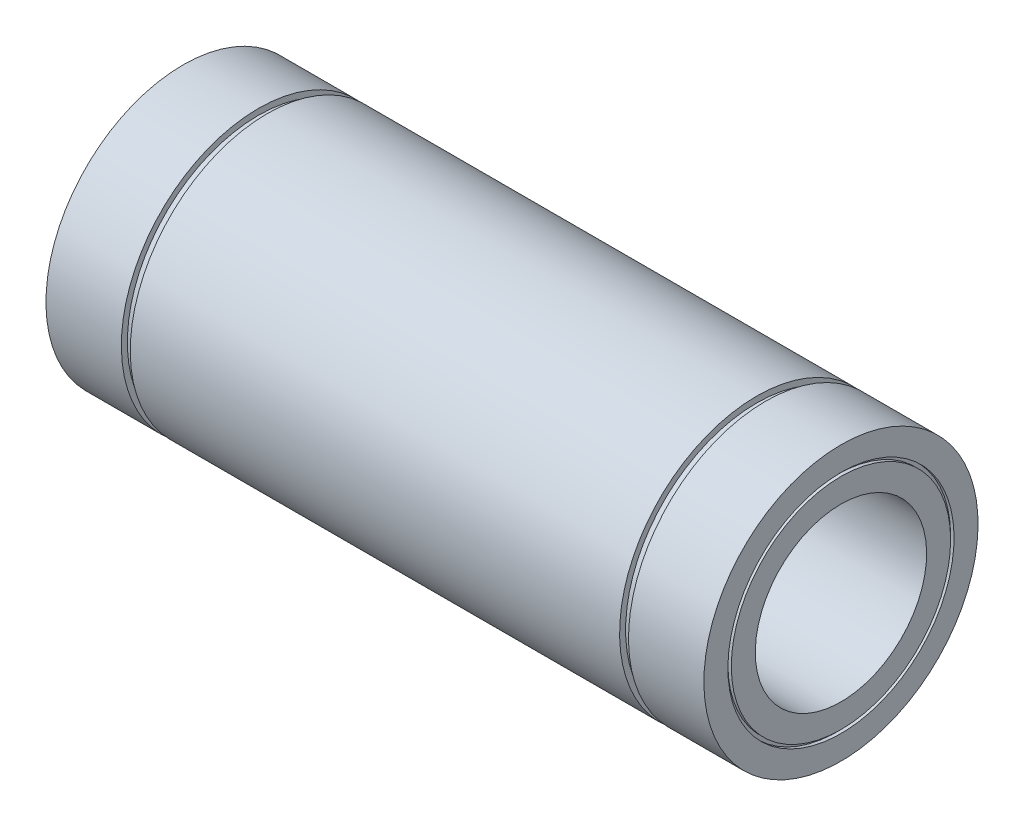
ISO-10303-21;
HEADER;
FILE_DESCRIPTION(('STEP AP214'),'2;1');
FILE_NAME('part.step','',(''),(''),'','','');
FILE_SCHEMA(('AUTOMOTIVE_DESIGN { 1 0 10303 214 1 1 1 1 }'));
ENDSEC;
DATA;
#1=APPLICATION_CONTEXT('core data for automotive mechanical design processes');
#2=APPLICATION_PROTOCOL_DEFINITION('international standard','automotive_design',2000,#1);
#3=PRODUCT_CONTEXT('',#1,'mechanical');
#4=PRODUCT('Part','Part','',(#3));
#5=PRODUCT_RELATED_PRODUCT_CATEGORY('part','',(#4));
#6=PRODUCT_DEFINITION_FORMATION('','',#4);
#7=PRODUCT_DEFINITION_CONTEXT('part definition',#1,'design');
#8=PRODUCT_DEFINITION('design','',#6,#7);
#9=PRODUCT_DEFINITION_SHAPE('','',#8);
#10=(LENGTH_UNIT() NAMED_UNIT(*) SI_UNIT(.MILLI.,.METRE.));
#11=(NAMED_UNIT(*) PLANE_ANGLE_UNIT() SI_UNIT($,.RADIAN.));
#12=(NAMED_UNIT(*) SI_UNIT($,.STERADIAN.) SOLID_ANGLE_UNIT());
#13=UNCERTAINTY_MEASURE_WITH_UNIT(LENGTH_MEASURE(1.E-05),#10,'distance_accuracy_value','');
#14=(GEOMETRIC_REPRESENTATION_CONTEXT(3) GLOBAL_UNCERTAINTY_ASSIGNED_CONTEXT((#13)) GLOBAL_UNIT_ASSIGNED_CONTEXT((#10,
#11,#12)) REPRESENTATION_CONTEXT('',''));
#15=CARTESIAN_POINT('',(0.,0.,0.));
#16=DIRECTION('',(0.,0.,1.));
#17=DIRECTION('',(1.,0.,0.));
#18=AXIS2_PLACEMENT_3D('',#15,#16,#17);
#19=CARTESIAN_POINT('',(-96.,33.,0.));
#20=DIRECTION('',(-1.,0.,0.));
#21=DIRECTION('',(0.,-1.,0.));
#22=AXIS2_PLACEMENT_3D('',#19,#20,#21);
#23=PLANE('',#22);
#24=CARTESIAN_POINT('',(-96.,0.,0.));
#25=DIRECTION('',(1.,0.,0.));
#26=DIRECTION('',(0.,1.,0.));
#27=AXIS2_PLACEMENT_3D('',#24,#25,#26);
#28=CIRCLE('',#27,33.);
#29=CARTESIAN_POINT('',(-96.,33.,0.));
#30=VERTEX_POINT('',#29);
#31=EDGE_CURVE('E124',#30,#30,#28,.T.);
#32=ORIENTED_EDGE('',*,*,#31,.T.);
#33=EDGE_LOOP('',(#32));
#34=FACE_BOUND('',#33,.T.);
#35=CARTESIAN_POINT('',(-96.,0.,0.));
#36=DIRECTION('',(1.,0.,0.));
#37=DIRECTION('',(0.,1.,0.));
#38=AXIS2_PLACEMENT_3D('',#35,#36,#37);
#39=CIRCLE('',#38,40.);
#40=CARTESIAN_POINT('',(-96.,40.,0.));
#41=VERTEX_POINT('',#40);
#42=EDGE_CURVE('E10',#41,#41,#39,.T.);
#43=ORIENTED_EDGE('',*,*,#42,.F.);
#44=EDGE_LOOP('',(#43));
#45=FACE_BOUND('',#44,.T.);
#46=ADVANCED_FACE('F40',(#34,#45),#23,.T.);
#47=CARTESIAN_POINT('',(0.,0.,0.));
#48=DIRECTION('',(1.,0.,0.));
#49=DIRECTION('',(0.,1.,0.));
#50=AXIS2_PLACEMENT_3D('',#47,#48,#49);
#51=CYLINDRICAL_SURFACE('',#50,40.);
#52=ORIENTED_EDGE('',*,*,#42,.T.);
#53=EDGE_LOOP('',(#52));
#54=FACE_BOUND('',#53,.T.);
#55=CARTESIAN_POINT('',(-74.,0.,0.));
#56=DIRECTION('',(1.,0.,0.));
#57=DIRECTION('',(0.,1.,0.));
#58=AXIS2_PLACEMENT_3D('',#55,#56,#57);
#59=CIRCLE('',#58,40.);
#60=CARTESIAN_POINT('',(-74.,40.,0.));
#61=VERTEX_POINT('',#60);
#62=EDGE_CURVE('E47',#61,#61,#59,.T.);
#63=ORIENTED_EDGE('',*,*,#62,.F.);
#64=EDGE_LOOP('',(#63));
#65=FACE_BOUND('',#64,.T.);
#66=ADVANCED_FACE('F142',(#54,#65),#51,.T.);
#67=CARTESIAN_POINT('',(-74.,40.,0.));
#68=DIRECTION('',(1.,0.,0.));
#69=DIRECTION('',(0.,1.,0.));
#70=AXIS2_PLACEMENT_3D('',#67,#68,#69);
#71=PLANE('',#70);
#72=ORIENTED_EDGE('',*,*,#62,.T.);
#73=EDGE_LOOP('',(#72));
#74=FACE_BOUND('',#73,.T.);
#75=CARTESIAN_POINT('',(-74.,0.,0.));
#76=DIRECTION('',(1.,0.,0.));
#77=DIRECTION('',(0.,1.,0.));
#78=AXIS2_PLACEMENT_3D('',#75,#76,#77);
#79=CIRCLE('',#78,38.25);
#80=CARTESIAN_POINT('',(-74.,38.25,0.));
#81=VERTEX_POINT('',#80);
#82=EDGE_CURVE('E54',#81,#81,#79,.T.);
#83=ORIENTED_EDGE('',*,*,#82,.F.);
#84=EDGE_LOOP('',(#83));
#85=FACE_BOUND('',#84,.T.);
#86=ADVANCED_FACE('F146',(#74,#85),#71,.T.);
#87=CARTESIAN_POINT('',(0.,0.,0.));
#88=DIRECTION('',(1.,0.,0.));
#89=DIRECTION('',(0.,1.,0.));
#90=AXIS2_PLACEMENT_3D('',#87,#88,#89);
#91=CYLINDRICAL_SURFACE('',#90,38.25);
#92=ORIENTED_EDGE('',*,*,#82,.T.);
#93=EDGE_LOOP('',(#92));
#94=FACE_BOUND('',#93,.T.);
#95=CARTESIAN_POINT('',(-71.4,0.,0.));
#96=DIRECTION('',(1.,0.,0.));
#97=DIRECTION('',(0.,1.,0.));
#98=AXIS2_PLACEMENT_3D('',#95,#96,#97);
#99=CIRCLE('',#98,38.25);
#100=CARTESIAN_POINT('',(-71.4,38.25,0.));
#101=VERTEX_POINT('',#100);
#102=EDGE_CURVE('E61',#101,#101,#99,.T.);
#103=ORIENTED_EDGE('',*,*,#102,.F.);
#104=EDGE_LOOP('',(#103));
#105=FACE_BOUND('',#104,.T.);
#106=ADVANCED_FACE('F150',(#94,#105),#91,.T.);
#107=CARTESIAN_POINT('',(-71.4,38.25,0.));
#108=DIRECTION('',(-1.,0.,0.));
#109=DIRECTION('',(0.,-1.,0.));
#110=AXIS2_PLACEMENT_3D('',#107,#108,#109);
#111=PLANE('',#110);
#112=ORIENTED_EDGE('',*,*,#102,.T.);
#113=EDGE_LOOP('',(#112));
#114=FACE_BOUND('',#113,.T.);
#115=CARTESIAN_POINT('',(-71.4,0.,0.));
#116=DIRECTION('',(1.,0.,0.));
#117=DIRECTION('',(0.,1.,0.));
#118=AXIS2_PLACEMENT_3D('',#115,#116,#117);
#119=CIRCLE('',#118,40.);
#120=CARTESIAN_POINT('',(-71.4,40.,0.));
#121=VERTEX_POINT('',#120);
#122=EDGE_CURVE('E67',#121,#121,#119,.T.);
#123=ORIENTED_EDGE('',*,*,#122,.F.);
#124=EDGE_LOOP('',(#123));
#125=FACE_BOUND('',#124,.T.);
#126=ADVANCED_FACE('F156',(#114,#125),#111,.T.);
#127=CARTESIAN_POINT('',(0.,0.,0.));
#128=DIRECTION('',(1.,0.,0.));
#129=DIRECTION('',(0.,1.,0.));
#130=AXIS2_PLACEMENT_3D('',#127,#128,#129);
#131=CYLINDRICAL_SURFACE('',#130,40.);
#132=ORIENTED_EDGE('',*,*,#122,.T.);
#133=EDGE_LOOP('',(#132));
#134=FACE_BOUND('',#133,.T.);
#135=CARTESIAN_POINT('',(71.4,0.,0.));
#136=DIRECTION('',(1.,0.,0.));
#137=DIRECTION('',(0.,1.,0.));
#138=AXIS2_PLACEMENT_3D('',#135,#136,#137);
#139=CIRCLE('',#138,40.);
#140=CARTESIAN_POINT('',(71.4,40.,0.));
#141=VERTEX_POINT('',#140);
#142=EDGE_CURVE('E71',#141,#141,#139,.T.);
#143=ORIENTED_EDGE('',*,*,#142,.F.);
#144=EDGE_LOOP('',(#143));
#145=FACE_BOUND('',#144,.T.);
#146=ADVANCED_FACE('F160',(#134,#145),#131,.T.);
#147=CARTESIAN_POINT('',(71.4,40.,0.));
#148=DIRECTION('',(1.,0.,0.));
#149=DIRECTION('',(0.,1.,0.));
#150=AXIS2_PLACEMENT_3D('',#147,#148,#149);
#151=PLANE('',#150);
#152=ORIENTED_EDGE('',*,*,#142,.T.);
#153=EDGE_LOOP('',(#152));
#154=FACE_BOUND('',#153,.T.);
#155=CARTESIAN_POINT('',(71.4,0.,0.));
#156=DIRECTION('',(1.,0.,0.));
#157=DIRECTION('',(0.,1.,0.));
#158=AXIS2_PLACEMENT_3D('',#155,#156,#157);
#159=CIRCLE('',#158,38.25);
#160=CARTESIAN_POINT('',(71.4,38.25,0.));
#161=VERTEX_POINT('',#160);
#162=EDGE_CURVE('E75',#161,#161,#159,.T.);
#163=ORIENTED_EDGE('',*,*,#162,.F.);
#164=EDGE_LOOP('',(#163));
#165=FACE_BOUND('',#164,.T.);
#166=ADVANCED_FACE('F164',(#154,#165),#151,.T.);
#167=CARTESIAN_POINT('',(0.,0.,0.));
#168=DIRECTION('',(1.,0.,0.));
#169=DIRECTION('',(0.,1.,0.));
#170=AXIS2_PLACEMENT_3D('',#167,#168,#169);
#171=CYLINDRICAL_SURFACE('',#170,38.25);
#172=ORIENTED_EDGE('',*,*,#162,.T.);
#173=EDGE_LOOP('',(#172));
#174=FACE_BOUND('',#173,.T.);
#175=CARTESIAN_POINT('',(74.,0.,0.));
#176=DIRECTION('',(1.,0.,0.));
#177=DIRECTION('',(0.,1.,0.));
#178=AXIS2_PLACEMENT_3D('',#175,#176,#177);
#179=CIRCLE('',#178,38.25);
#180=CARTESIAN_POINT('',(74.,38.25,0.));
#181=VERTEX_POINT('',#180);
#182=EDGE_CURVE('E79',#181,#181,#179,.T.);
#183=ORIENTED_EDGE('',*,*,#182,.F.);
#184=EDGE_LOOP('',(#183));
#185=FACE_BOUND('',#184,.T.);
#186=ADVANCED_FACE('F168',(#174,#185),#171,.T.);
#187=CARTESIAN_POINT('',(74.,38.25,0.));
#188=DIRECTION('',(-1.,0.,0.));
#189=DIRECTION('',(0.,-1.,0.));
#190=AXIS2_PLACEMENT_3D('',#187,#188,#189);
#191=PLANE('',#190);
#192=ORIENTED_EDGE('',*,*,#182,.T.);
#193=EDGE_LOOP('',(#192));
#194=FACE_BOUND('',#193,.T.);
#195=CARTESIAN_POINT('',(74.,0.,0.));
#196=DIRECTION('',(1.,0.,0.));
#197=DIRECTION('',(0.,1.,0.));
#198=AXIS2_PLACEMENT_3D('',#195,#196,#197);
#199=CIRCLE('',#198,40.);
#200=CARTESIAN_POINT('',(74.,40.,0.));
#201=VERTEX_POINT('',#200);
#202=EDGE_CURVE('E83',#201,#201,#199,.T.);
#203=ORIENTED_EDGE('',*,*,#202,.F.);
#204=EDGE_LOOP('',(#203));
#205=FACE_BOUND('',#204,.T.);
#206=ADVANCED_FACE('F172',(#194,#205),#191,.T.);
#207=CARTESIAN_POINT('',(0.,0.,0.));
#208=DIRECTION('',(1.,0.,0.));
#209=DIRECTION('',(0.,1.,0.));
#210=AXIS2_PLACEMENT_3D('',#207,#208,#209);
#211=CYLINDRICAL_SURFACE('',#210,40.);
#212=ORIENTED_EDGE('',*,*,#202,.T.);
#213=EDGE_LOOP('',(#212));
#214=FACE_BOUND('',#213,.T.);
#215=CARTESIAN_POINT('',(96.,0.,0.));
#216=DIRECTION('',(1.,0.,0.));
#217=DIRECTION('',(0.,1.,0.));
#218=AXIS2_PLACEMENT_3D('',#215,#216,#217);
#219=CIRCLE('',#218,40.);
#220=CARTESIAN_POINT('',(96.,40.,0.));
#221=VERTEX_POINT('',#220);
#222=EDGE_CURVE('E86',#221,#221,#219,.T.);
#223=ORIENTED_EDGE('',*,*,#222,.F.);
#224=EDGE_LOOP('',(#223));
#225=FACE_BOUND('',#224,.T.);
#226=ADVANCED_FACE('F176',(#214,#225),#211,.T.);
#227=CARTESIAN_POINT('',(96.,40.,0.));
#228=DIRECTION('',(1.,0.,0.));
#229=DIRECTION('',(0.,1.,0.));
#230=AXIS2_PLACEMENT_3D('',#227,#228,#229);
#231=PLANE('',#230);
#232=ORIENTED_EDGE('',*,*,#222,.T.);
#233=EDGE_LOOP('',(#232));
#234=FACE_BOUND('',#233,.T.);
#235=CARTESIAN_POINT('',(96.,0.,0.));
#236=DIRECTION('',(1.,0.,0.));
#237=DIRECTION('',(0.,1.,0.));
#238=AXIS2_PLACEMENT_3D('',#235,#236,#237);
#239=CIRCLE('',#238,33.);
#240=CARTESIAN_POINT('',(96.,33.,0.));
#241=VERTEX_POINT('',#240);
#242=EDGE_CURVE('E90',#241,#241,#239,.T.);
#243=ORIENTED_EDGE('',*,*,#242,.F.);
#244=EDGE_LOOP('',(#243));
#245=FACE_BOUND('',#244,.T.);
#246=ADVANCED_FACE('F180',(#234,#245),#231,.T.);
#247=CARTESIAN_POINT('',(0.,0.,0.));
#248=DIRECTION('',(1.,0.,0.));
#249=DIRECTION('',(0.,1.,0.));
#250=AXIS2_PLACEMENT_3D('',#247,#248,#249);
#251=CYLINDRICAL_SURFACE('',#250,33.);
#252=ORIENTED_EDGE('',*,*,#242,.T.);
#253=EDGE_LOOP('',(#252));
#254=FACE_BOUND('',#253,.T.);
#255=CARTESIAN_POINT('',(95.,0.,0.));
#256=DIRECTION('',(1.,0.,0.));
#257=DIRECTION('',(0.,1.,0.));
#258=AXIS2_PLACEMENT_3D('',#255,#256,#257);
#259=CIRCLE('',#258,33.);
#260=CARTESIAN_POINT('',(95.,33.,0.));
#261=VERTEX_POINT('',#260);
#262=EDGE_CURVE('E94',#261,#261,#259,.T.);
#263=ORIENTED_EDGE('',*,*,#262,.F.);
#264=EDGE_LOOP('',(#263));
#265=FACE_BOUND('',#264,.T.);
#266=ADVANCED_FACE('F184',(#254,#265),#251,.F.);
#267=CARTESIAN_POINT('',(95.,33.,0.));
#268=DIRECTION('',(1.,0.,0.));
#269=DIRECTION('',(0.,1.,0.));
#270=AXIS2_PLACEMENT_3D('',#267,#268,#269);
#271=PLANE('',#270);
#272=ORIENTED_EDGE('',*,*,#262,.T.);
#273=EDGE_LOOP('',(#272));
#274=FACE_BOUND('',#273,.T.);
#275=CARTESIAN_POINT('',(95.,0.,0.));
#276=DIRECTION('',(1.,0.,0.));
#277=DIRECTION('',(0.,1.,0.));
#278=AXIS2_PLACEMENT_3D('',#275,#276,#277);
#279=CIRCLE('',#278,32.);
#280=CARTESIAN_POINT('',(95.,32.,0.));
#281=VERTEX_POINT('',#280);
#282=EDGE_CURVE('E98',#281,#281,#279,.T.);
#283=ORIENTED_EDGE('',*,*,#282,.F.);
#284=EDGE_LOOP('',(#283));
#285=FACE_BOUND('',#284,.T.);
#286=ADVANCED_FACE('F188',(#274,#285),#271,.T.);
#287=CARTESIAN_POINT('',(0.,0.,0.));
#288=DIRECTION('',(1.,0.,0.));
#289=DIRECTION('',(0.,1.,0.));
#290=AXIS2_PLACEMENT_3D('',#287,#288,#289);
#291=CYLINDRICAL_SURFACE('',#290,32.);
#292=ORIENTED_EDGE('',*,*,#282,.T.);
#293=EDGE_LOOP('',(#292));
#294=FACE_BOUND('',#293,.T.);
#295=CARTESIAN_POINT('',(96.,0.,0.));
#296=DIRECTION('',(1.,0.,0.));
#297=DIRECTION('',(0.,1.,0.));
#298=AXIS2_PLACEMENT_3D('',#295,#296,#297);
#299=CIRCLE('',#298,32.);
#300=CARTESIAN_POINT('',(96.,32.,0.));
#301=VERTEX_POINT('',#300);
#302=EDGE_CURVE('E101',#301,#301,#299,.T.);
#303=ORIENTED_EDGE('',*,*,#302,.F.);
#304=EDGE_LOOP('',(#303));
#305=FACE_BOUND('',#304,.T.);
#306=ADVANCED_FACE('F192',(#294,#305),#291,.T.);
#307=CARTESIAN_POINT('',(96.,32.,0.));
#308=DIRECTION('',(1.,0.,0.));
#309=DIRECTION('',(0.,1.,0.));
#310=AXIS2_PLACEMENT_3D('',#307,#308,#309);
#311=PLANE('',#310);
#312=ORIENTED_EDGE('',*,*,#302,.T.);
#313=EDGE_LOOP('',(#312));
#314=FACE_BOUND('',#313,.T.);
#315=CARTESIAN_POINT('',(96.,0.,0.));
#316=DIRECTION('',(1.,0.,0.));
#317=DIRECTION('',(0.,1.,0.));
#318=AXIS2_PLACEMENT_3D('',#315,#316,#317);
#319=CIRCLE('',#318,25.);
#320=CARTESIAN_POINT('',(96.,25.,0.));
#321=VERTEX_POINT('',#320);
#322=EDGE_CURVE('E104',#321,#321,#319,.T.);
#323=ORIENTED_EDGE('',*,*,#322,.F.);
#324=EDGE_LOOP('',(#323));
#325=FACE_BOUND('',#324,.T.);
#326=ADVANCED_FACE('F196',(#314,#325),#311,.T.);
#327=CARTESIAN_POINT('',(0.,0.,0.));
#328=DIRECTION('',(1.,0.,0.));
#329=DIRECTION('',(0.,1.,0.));
#330=AXIS2_PLACEMENT_3D('',#327,#328,#329);
#331=CYLINDRICAL_SURFACE('',#330,25.);
#332=ORIENTED_EDGE('',*,*,#322,.T.);
#333=EDGE_LOOP('',(#332));
#334=FACE_BOUND('',#333,.T.);
#335=CARTESIAN_POINT('',(-96.,0.,0.));
#336=DIRECTION('',(1.,0.,0.));
#337=DIRECTION('',(0.,1.,0.));
#338=AXIS2_PLACEMENT_3D('',#335,#336,#337);
#339=CIRCLE('',#338,25.);
#340=CARTESIAN_POINT('',(-96.,25.,0.));
#341=VERTEX_POINT('',#340);
#342=EDGE_CURVE('E108',#341,#341,#339,.T.);
#343=ORIENTED_EDGE('',*,*,#342,.F.);
#344=EDGE_LOOP('',(#343));
#345=FACE_BOUND('',#344,.T.);
#346=ADVANCED_FACE('F200',(#334,#345),#331,.F.);
#347=CARTESIAN_POINT('',(-96.,25.,0.));
#348=DIRECTION('',(-1.,0.,0.));
#349=DIRECTION('',(0.,-1.,0.));
#350=AXIS2_PLACEMENT_3D('',#347,#348,#349);
#351=PLANE('',#350);
#352=ORIENTED_EDGE('',*,*,#342,.T.);
#353=EDGE_LOOP('',(#352));
#354=FACE_BOUND('',#353,.T.);
#355=CARTESIAN_POINT('',(-96.,0.,0.));
#356=DIRECTION('',(1.,0.,0.));
#357=DIRECTION('',(0.,1.,0.));
#358=AXIS2_PLACEMENT_3D('',#355,#356,#357);
#359=CIRCLE('',#358,32.);
#360=CARTESIAN_POINT('',(-96.,32.,0.));
#361=VERTEX_POINT('',#360);
#362=EDGE_CURVE('E112',#361,#361,#359,.T.);
#363=ORIENTED_EDGE('',*,*,#362,.F.);
#364=EDGE_LOOP('',(#363));
#365=FACE_BOUND('',#364,.T.);
#366=ADVANCED_FACE('F204',(#354,#365),#351,.T.);
#367=CARTESIAN_POINT('',(0.,0.,0.));
#368=DIRECTION('',(1.,0.,0.));
#369=DIRECTION('',(0.,1.,0.));
#370=AXIS2_PLACEMENT_3D('',#367,#368,#369);
#371=CYLINDRICAL_SURFACE('',#370,32.);
#372=ORIENTED_EDGE('',*,*,#362,.T.);
#373=EDGE_LOOP('',(#372));
#374=FACE_BOUND('',#373,.T.);
#375=CARTESIAN_POINT('',(-95.,0.,0.));
#376=DIRECTION('',(1.,0.,0.));
#377=DIRECTION('',(0.,1.,0.));
#378=AXIS2_PLACEMENT_3D('',#375,#376,#377);
#379=CIRCLE('',#378,32.);
#380=CARTESIAN_POINT('',(-95.,32.,0.));
#381=VERTEX_POINT('',#380);
#382=EDGE_CURVE('E116',#381,#381,#379,.T.);
#383=ORIENTED_EDGE('',*,*,#382,.F.);
#384=EDGE_LOOP('',(#383));
#385=FACE_BOUND('',#384,.T.);
#386=ADVANCED_FACE('F138',(#374,#385),#371,.T.);
#387=CARTESIAN_POINT('',(-95.,33.,0.));
#388=DIRECTION('',(-1.,0.,0.));
#389=DIRECTION('',(0.,-1.,0.));
#390=AXIS2_PLACEMENT_3D('',#387,#388,#389);
#391=PLANE('',#390);
#392=ORIENTED_EDGE('',*,*,#382,.T.);
#393=EDGE_LOOP('',(#392));
#394=FACE_BOUND('',#393,.T.);
#395=CARTESIAN_POINT('',(-95.,0.,0.));
#396=DIRECTION('',(1.,0.,0.));
#397=DIRECTION('',(0.,1.,0.));
#398=AXIS2_PLACEMENT_3D('',#395,#396,#397);
#399=CIRCLE('',#398,33.);
#400=CARTESIAN_POINT('',(-95.,33.,0.));
#401=VERTEX_POINT('',#400);
#402=EDGE_CURVE('E120',#401,#401,#399,.T.);
#403=ORIENTED_EDGE('',*,*,#402,.F.);
#404=EDGE_LOOP('',(#403));
#405=FACE_BOUND('',#404,.T.);
#406=ADVANCED_FACE('F132',(#394,#405),#391,.T.);
#407=CARTESIAN_POINT('',(0.,0.,0.));
#408=DIRECTION('',(1.,0.,0.));
#409=DIRECTION('',(0.,1.,0.));
#410=AXIS2_PLACEMENT_3D('',#407,#408,#409);
#411=CYLINDRICAL_SURFACE('',#410,33.);
#412=ORIENTED_EDGE('',*,*,#402,.T.);
#413=EDGE_LOOP('',(#412));
#414=FACE_BOUND('',#413,.T.);
#415=ORIENTED_EDGE('',*,*,#31,.F.);
#416=EDGE_LOOP('',(#415));
#417=FACE_BOUND('',#416,.T.);
#418=ADVANCED_FACE('F130',(#414,#417),#411,.F.);
#419=CLOSED_SHELL('',(#46,#66,#86,#106,#126,#146,#166,#186,#206,#226,#246,#266,#286,#306,#326,
#346,#366,#386,#406,#418));
#420=MANIFOLD_SOLID_BREP('B2',#419);
#421=ADVANCED_BREP_SHAPE_REPRESENTATION('',(#18,#420),#14);
#422=SHAPE_DEFINITION_REPRESENTATION(#9,#421);
ENDSEC;
END-ISO-10303-21;
